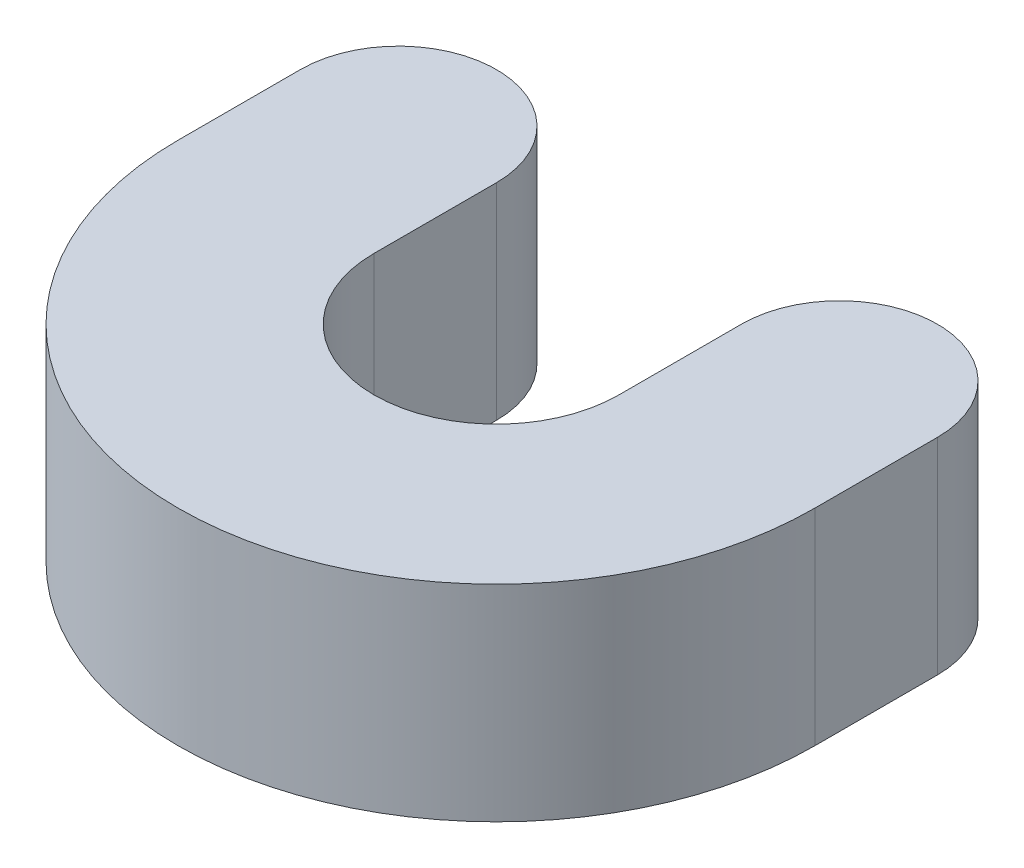
ISO-10303-21;
HEADER;
FILE_DESCRIPTION(('STEP AP214'),'2;1');
FILE_NAME('part.step','',(''),(''),'','','');
FILE_SCHEMA(('AUTOMOTIVE_DESIGN { 1 0 10303 214 1 1 1 1 }'));
ENDSEC;
DATA;
#1=APPLICATION_CONTEXT('core data for automotive mechanical design processes');
#2=APPLICATION_PROTOCOL_DEFINITION('international standard','automotive_design',2000,#1);
#3=PRODUCT_CONTEXT('',#1,'mechanical');
#4=PRODUCT('Part','Part','',(#3));
#5=PRODUCT_RELATED_PRODUCT_CATEGORY('part','',(#4));
#6=PRODUCT_DEFINITION_FORMATION('','',#4);
#7=PRODUCT_DEFINITION_CONTEXT('part definition',#1,'design');
#8=PRODUCT_DEFINITION('design','',#6,#7);
#9=PRODUCT_DEFINITION_SHAPE('','',#8);
#10=(LENGTH_UNIT() NAMED_UNIT(*) SI_UNIT(.MILLI.,.METRE.));
#11=(NAMED_UNIT(*) PLANE_ANGLE_UNIT() SI_UNIT($,.RADIAN.));
#12=(NAMED_UNIT(*) SI_UNIT($,.STERADIAN.) SOLID_ANGLE_UNIT());
#13=UNCERTAINTY_MEASURE_WITH_UNIT(LENGTH_MEASURE(1.E-05),#10,'distance_accuracy_value','');
#14=(GEOMETRIC_REPRESENTATION_CONTEXT(3) GLOBAL_UNCERTAINTY_ASSIGNED_CONTEXT((#13)) GLOBAL_UNIT_ASSIGNED_CONTEXT((#10,
#11,#12)) REPRESENTATION_CONTEXT('',''));
#15=CARTESIAN_POINT('',(0.,0.,0.));
#16=DIRECTION('',(0.,0.,1.));
#17=DIRECTION('',(1.,0.,0.));
#18=AXIS2_PLACEMENT_3D('',#15,#16,#17);
#19=CARTESIAN_POINT('',(0.,21.,0.));
#20=DIRECTION('',(0.,-1.,0.));
#21=DIRECTION('',(0.,0.,-1.));
#22=AXIS2_PLACEMENT_3D('',#19,#20,#21);
#23=CYLINDRICAL_SURFACE('',#22,32.5);
#24=CARTESIAN_POINT('',(0.,0.,0.));
#25=DIRECTION('',(0.,1.,0.));
#26=DIRECTION('',(0.,0.,-1.));
#27=AXIS2_PLACEMENT_3D('',#24,#25,#26);
#28=CIRCLE('',#27,32.5);
#29=CARTESIAN_POINT('',(-32.5,0.,0.));
#30=VERTEX_POINT('',#29);
#31=CARTESIAN_POINT('',(32.5,0.,0.));
#32=VERTEX_POINT('',#31);
#33=EDGE_CURVE('E129',#30,#32,#28,.T.);
#34=ORIENTED_EDGE('',*,*,#33,.T.);
#35=DIRECTION('',(0.,-1.,0.));
#36=VECTOR('',#35,1.);
#37=CARTESIAN_POINT('',(32.5,21.,0.));
#38=LINE('',#37,#36);
#39=CARTESIAN_POINT('',(32.5,21.,0.));
#40=VERTEX_POINT('',#39);
#41=EDGE_CURVE('E11',#40,#32,#38,.T.);
#42=ORIENTED_EDGE('',*,*,#41,.F.);
#43=CARTESIAN_POINT('',(0.,21.,0.));
#44=DIRECTION('',(0.,1.,0.));
#45=DIRECTION('',(0.,0.,-1.));
#46=AXIS2_PLACEMENT_3D('',#43,#44,#45);
#47=CIRCLE('',#46,32.5);
#48=CARTESIAN_POINT('',(-32.5,21.,0.));
#49=VERTEX_POINT('',#48);
#50=EDGE_CURVE('E143',#49,#40,#47,.T.);
#51=ORIENTED_EDGE('',*,*,#50,.F.);
#52=DIRECTION('',(0.,-1.,0.));
#53=VECTOR('',#52,1.);
#54=CARTESIAN_POINT('',(-32.5,21.,0.));
#55=LINE('',#54,#53);
#56=EDGE_CURVE('E125',#49,#30,#55,.T.);
#57=ORIENTED_EDGE('',*,*,#56,.T.);
#58=EDGE_LOOP('',(#34,#42,#51,#57));
#59=FACE_BOUND('',#58,.T.);
#60=ADVANCED_FACE('F33',(#59),#23,.T.);
#61=CARTESIAN_POINT('',(32.5,21.,0.));
#62=DIRECTION('',(-1.,0.,0.));
#63=DIRECTION('',(0.,0.,1.));
#64=AXIS2_PLACEMENT_3D('',#61,#62,#63);
#65=PLANE('',#64);
#66=DIRECTION('',(0.,0.,-1.));
#67=VECTOR('',#66,1.);
#68=CARTESIAN_POINT('',(32.5,0.,0.));
#69=LINE('',#68,#67);
#70=CARTESIAN_POINT('',(32.5,0.,-12.5));
#71=VERTEX_POINT('',#70);
#72=EDGE_CURVE('E132',#32,#71,#69,.T.);
#73=ORIENTED_EDGE('',*,*,#72,.T.);
#74=DIRECTION('',(0.,-1.,0.));
#75=VECTOR('',#74,1.);
#76=CARTESIAN_POINT('',(32.5,21.,-12.5));
#77=LINE('',#76,#75);
#78=CARTESIAN_POINT('',(32.5,21.,-12.5));
#79=VERTEX_POINT('',#78);
#80=EDGE_CURVE('E41',#79,#71,#77,.T.);
#81=ORIENTED_EDGE('',*,*,#80,.F.);
#82=DIRECTION('',(0.,0.,-1.));
#83=VECTOR('',#82,1.);
#84=CARTESIAN_POINT('',(32.5,21.,0.));
#85=LINE('',#84,#83);
#86=EDGE_CURVE('E92',#40,#79,#85,.T.);
#87=ORIENTED_EDGE('',*,*,#86,.F.);
#88=ORIENTED_EDGE('',*,*,#41,.T.);
#89=EDGE_LOOP('',(#73,#81,#87,#88));
#90=FACE_BOUND('',#89,.T.);
#91=ADVANCED_FACE('F178',(#90),#65,.F.);
#92=CARTESIAN_POINT('',(22.5,21.,-12.5));
#93=DIRECTION('',(0.,-1.,0.));
#94=DIRECTION('',(0.,0.,-1.));
#95=AXIS2_PLACEMENT_3D('',#92,#93,#94);
#96=CYLINDRICAL_SURFACE('',#95,10.);
#97=CARTESIAN_POINT('',(22.5,0.,-12.5));
#98=DIRECTION('',(0.,1.,0.));
#99=DIRECTION('',(0.,0.,-1.));
#100=AXIS2_PLACEMENT_3D('',#97,#98,#99);
#101=CIRCLE('',#100,10.);
#102=CARTESIAN_POINT('',(12.5,0.,-12.5));
#103=VERTEX_POINT('',#102);
#104=EDGE_CURVE('E134',#71,#103,#101,.T.);
#105=ORIENTED_EDGE('',*,*,#104,.T.);
#106=DIRECTION('',(0.,-1.,0.));
#107=VECTOR('',#106,1.);
#108=CARTESIAN_POINT('',(12.5,21.,-12.5));
#109=LINE('',#108,#107);
#110=CARTESIAN_POINT('',(12.5,21.,-12.5));
#111=VERTEX_POINT('',#110);
#112=EDGE_CURVE('E150',#111,#103,#109,.T.);
#113=ORIENTED_EDGE('',*,*,#112,.F.);
#114=CARTESIAN_POINT('',(22.5,21.,-12.5));
#115=DIRECTION('',(0.,1.,0.));
#116=DIRECTION('',(0.,0.,-1.));
#117=AXIS2_PLACEMENT_3D('',#114,#115,#116);
#118=CIRCLE('',#117,10.);
#119=EDGE_CURVE('E158',#79,#111,#118,.T.);
#120=ORIENTED_EDGE('',*,*,#119,.F.);
#121=ORIENTED_EDGE('',*,*,#80,.T.);
#122=EDGE_LOOP('',(#105,#113,#120,#121));
#123=FACE_BOUND('',#122,.T.);
#124=ADVANCED_FACE('F156',(#123),#96,.T.);
#125=CARTESIAN_POINT('',(12.5,21.,0.));
#126=DIRECTION('',(1.,0.,0.));
#127=DIRECTION('',(0.,0.,-1.));
#128=AXIS2_PLACEMENT_3D('',#125,#126,#127);
#129=PLANE('',#128);
#130=DIRECTION('',(0.,0.,1.));
#131=VECTOR('',#130,1.);
#132=CARTESIAN_POINT('',(12.5,0.,0.));
#133=LINE('',#132,#131);
#134=CARTESIAN_POINT('',(12.5,0.,0.));
#135=VERTEX_POINT('',#134);
#136=EDGE_CURVE('E136',#103,#135,#133,.T.);
#137=ORIENTED_EDGE('',*,*,#136,.T.);
#138=DIRECTION('',(0.,-1.,0.));
#139=VECTOR('',#138,1.);
#140=CARTESIAN_POINT('',(12.5,21.,0.));
#141=LINE('',#140,#139);
#142=CARTESIAN_POINT('',(12.5,21.,0.));
#143=VERTEX_POINT('',#142);
#144=EDGE_CURVE('E147',#143,#135,#141,.T.);
#145=ORIENTED_EDGE('',*,*,#144,.F.);
#146=DIRECTION('',(0.,0.,1.));
#147=VECTOR('',#146,1.);
#148=CARTESIAN_POINT('',(12.5,21.,0.));
#149=LINE('',#148,#147);
#150=EDGE_CURVE('E170',#111,#143,#149,.T.);
#151=ORIENTED_EDGE('',*,*,#150,.F.);
#152=ORIENTED_EDGE('',*,*,#112,.T.);
#153=EDGE_LOOP('',(#137,#145,#151,#152));
#154=FACE_BOUND('',#153,.T.);
#155=ADVANCED_FACE('F166',(#154),#129,.F.);
#156=CARTESIAN_POINT('',(0.,21.,0.));
#157=DIRECTION('',(0.,-1.,0.));
#158=DIRECTION('',(0.,0.,-1.));
#159=AXIS2_PLACEMENT_3D('',#156,#157,#158);
#160=CYLINDRICAL_SURFACE('',#159,12.5);
#161=CARTESIAN_POINT('',(0.,0.,0.));
#162=DIRECTION('',(0.,-1.,0.));
#163=DIRECTION('',(0.,0.,1.));
#164=AXIS2_PLACEMENT_3D('',#161,#162,#163);
#165=CIRCLE('',#164,12.5);
#166=CARTESIAN_POINT('',(-12.5,0.,0.));
#167=VERTEX_POINT('',#166);
#168=EDGE_CURVE('E138',#135,#167,#165,.T.);
#169=ORIENTED_EDGE('',*,*,#168,.T.);
#170=DIRECTION('',(0.,-1.,0.));
#171=VECTOR('',#170,1.);
#172=CARTESIAN_POINT('',(-12.5,21.,0.));
#173=LINE('',#172,#171);
#174=CARTESIAN_POINT('',(-12.5,21.,0.));
#175=VERTEX_POINT('',#174);
#176=EDGE_CURVE('E120',#175,#167,#173,.T.);
#177=ORIENTED_EDGE('',*,*,#176,.F.);
#178=CARTESIAN_POINT('',(0.,21.,0.));
#179=DIRECTION('',(0.,-1.,0.));
#180=DIRECTION('',(0.,0.,1.));
#181=AXIS2_PLACEMENT_3D('',#178,#179,#180);
#182=CIRCLE('',#181,12.5);
#183=EDGE_CURVE('E111',#143,#175,#182,.T.);
#184=ORIENTED_EDGE('',*,*,#183,.F.);
#185=ORIENTED_EDGE('',*,*,#144,.T.);
#186=EDGE_LOOP('',(#169,#177,#184,#185));
#187=FACE_BOUND('',#186,.T.);
#188=ADVANCED_FACE('F169',(#187),#160,.F.);
#189=CARTESIAN_POINT('',(-12.5,21.,0.));
#190=DIRECTION('',(-1.,0.,0.));
#191=DIRECTION('',(0.,0.,1.));
#192=AXIS2_PLACEMENT_3D('',#189,#190,#191);
#193=PLANE('',#192);
#194=DIRECTION('',(0.,0.,-1.));
#195=VECTOR('',#194,1.);
#196=CARTESIAN_POINT('',(-12.5,0.,0.));
#197=LINE('',#196,#195);
#198=CARTESIAN_POINT('',(-12.5,0.,-12.5));
#199=VERTEX_POINT('',#198);
#200=EDGE_CURVE('E119',#167,#199,#197,.T.);
#201=ORIENTED_EDGE('',*,*,#200,.T.);
#202=DIRECTION('',(0.,-1.,0.));
#203=VECTOR('',#202,1.);
#204=CARTESIAN_POINT('',(-12.5,21.,-12.5));
#205=LINE('',#204,#203);
#206=CARTESIAN_POINT('',(-12.5,21.,-12.5));
#207=VERTEX_POINT('',#206);
#208=EDGE_CURVE('E116',#207,#199,#205,.T.);
#209=ORIENTED_EDGE('',*,*,#208,.F.);
#210=DIRECTION('',(0.,0.,-1.));
#211=VECTOR('',#210,1.);
#212=CARTESIAN_POINT('',(-12.5,21.,0.));
#213=LINE('',#212,#211);
#214=EDGE_CURVE('E105',#175,#207,#213,.T.);
#215=ORIENTED_EDGE('',*,*,#214,.F.);
#216=ORIENTED_EDGE('',*,*,#176,.T.);
#217=EDGE_LOOP('',(#201,#209,#215,#216));
#218=FACE_BOUND('',#217,.T.);
#219=ADVANCED_FACE('F117',(#218),#193,.F.);
#220=CARTESIAN_POINT('',(-22.5,21.,-12.5));
#221=DIRECTION('',(0.,-1.,0.));
#222=DIRECTION('',(0.,0.,-1.));
#223=AXIS2_PLACEMENT_3D('',#220,#221,#222);
#224=CYLINDRICAL_SURFACE('',#223,10.);
#225=CARTESIAN_POINT('',(-22.5,0.,-12.5));
#226=DIRECTION('',(0.,1.,0.));
#227=DIRECTION('',(0.,0.,-1.));
#228=AXIS2_PLACEMENT_3D('',#225,#226,#227);
#229=CIRCLE('',#228,10.);
#230=CARTESIAN_POINT('',(-32.5,0.,-12.5));
#231=VERTEX_POINT('',#230);
#232=EDGE_CURVE('E78',#199,#231,#229,.T.);
#233=ORIENTED_EDGE('',*,*,#232,.T.);
#234=DIRECTION('',(0.,-1.,0.));
#235=VECTOR('',#234,1.);
#236=CARTESIAN_POINT('',(-32.5,21.,-12.5));
#237=LINE('',#236,#235);
#238=CARTESIAN_POINT('',(-32.5,21.,-12.5));
#239=VERTEX_POINT('',#238);
#240=EDGE_CURVE('E121',#239,#231,#237,.T.);
#241=ORIENTED_EDGE('',*,*,#240,.F.);
#242=CARTESIAN_POINT('',(-22.5,21.,-12.5));
#243=DIRECTION('',(0.,1.,0.));
#244=DIRECTION('',(0.,0.,-1.));
#245=AXIS2_PLACEMENT_3D('',#242,#243,#244);
#246=CIRCLE('',#245,10.);
#247=EDGE_CURVE('E109',#207,#239,#246,.T.);
#248=ORIENTED_EDGE('',*,*,#247,.F.);
#249=ORIENTED_EDGE('',*,*,#208,.T.);
#250=EDGE_LOOP('',(#233,#241,#248,#249));
#251=FACE_BOUND('',#250,.T.);
#252=ADVANCED_FACE('F123',(#251),#224,.T.);
#253=CARTESIAN_POINT('',(-32.5,21.,0.));
#254=DIRECTION('',(1.,0.,0.));
#255=DIRECTION('',(0.,0.,-1.));
#256=AXIS2_PLACEMENT_3D('',#253,#254,#255);
#257=PLANE('',#256);
#258=DIRECTION('',(0.,0.,1.));
#259=VECTOR('',#258,1.);
#260=CARTESIAN_POINT('',(-32.5,0.,0.));
#261=LINE('',#260,#259);
#262=EDGE_CURVE('E84',#231,#30,#261,.T.);
#263=ORIENTED_EDGE('',*,*,#262,.T.);
#264=ORIENTED_EDGE('',*,*,#56,.F.);
#265=DIRECTION('',(0.,0.,1.));
#266=VECTOR('',#265,1.);
#267=CARTESIAN_POINT('',(-32.5,21.,0.));
#268=LINE('',#267,#266);
#269=EDGE_CURVE('E49',#239,#49,#268,.T.);
#270=ORIENTED_EDGE('',*,*,#269,.F.);
#271=ORIENTED_EDGE('',*,*,#240,.T.);
#272=EDGE_LOOP('',(#263,#264,#270,#271));
#273=FACE_BOUND('',#272,.T.);
#274=ADVANCED_FACE('F194',(#273),#257,.F.);
#275=CARTESIAN_POINT('',(0.,21.,0.));
#276=DIRECTION('',(0.,-1.,0.));
#277=DIRECTION('',(0.,0.,-1.));
#278=AXIS2_PLACEMENT_3D('',#275,#276,#277);
#279=PLANE('',#278);
#280=ORIENTED_EDGE('',*,*,#50,.T.);
#281=ORIENTED_EDGE('',*,*,#86,.T.);
#282=ORIENTED_EDGE('',*,*,#119,.T.);
#283=ORIENTED_EDGE('',*,*,#150,.T.);
#284=ORIENTED_EDGE('',*,*,#183,.T.);
#285=ORIENTED_EDGE('',*,*,#214,.T.);
#286=ORIENTED_EDGE('',*,*,#247,.T.);
#287=ORIENTED_EDGE('',*,*,#269,.T.);
#288=EDGE_LOOP('',(#280,#281,#282,#283,#284,#285,#286,#287));
#289=FACE_BOUND('',#288,.T.);
#290=ADVANCED_FACE('F107',(#289),#279,.F.);
#291=CARTESIAN_POINT('',(0.,0.,0.));
#292=DIRECTION('',(0.,-1.,0.));
#293=DIRECTION('',(0.,0.,-1.));
#294=AXIS2_PLACEMENT_3D('',#291,#292,#293);
#295=PLANE('',#294);
#296=ORIENTED_EDGE('',*,*,#33,.F.);
#297=ORIENTED_EDGE('',*,*,#262,.F.);
#298=ORIENTED_EDGE('',*,*,#232,.F.);
#299=ORIENTED_EDGE('',*,*,#200,.F.);
#300=ORIENTED_EDGE('',*,*,#168,.F.);
#301=ORIENTED_EDGE('',*,*,#136,.F.);
#302=ORIENTED_EDGE('',*,*,#104,.F.);
#303=ORIENTED_EDGE('',*,*,#72,.F.);
#304=EDGE_LOOP('',(#296,#297,#298,#299,#300,#301,#302,#303));
#305=FACE_BOUND('',#304,.T.);
#306=ADVANCED_FACE('F162',(#305),#295,.T.);
#307=CLOSED_SHELL('',(#60,#91,#124,#155,#188,#219,#252,#274,#290,#306));
#308=MANIFOLD_SOLID_BREP('B2',#307);
#309=ADVANCED_BREP_SHAPE_REPRESENTATION('',(#18,#308),#14);
#310=SHAPE_DEFINITION_REPRESENTATION(#9,#309);
ENDSEC;
END-ISO-10303-21;
